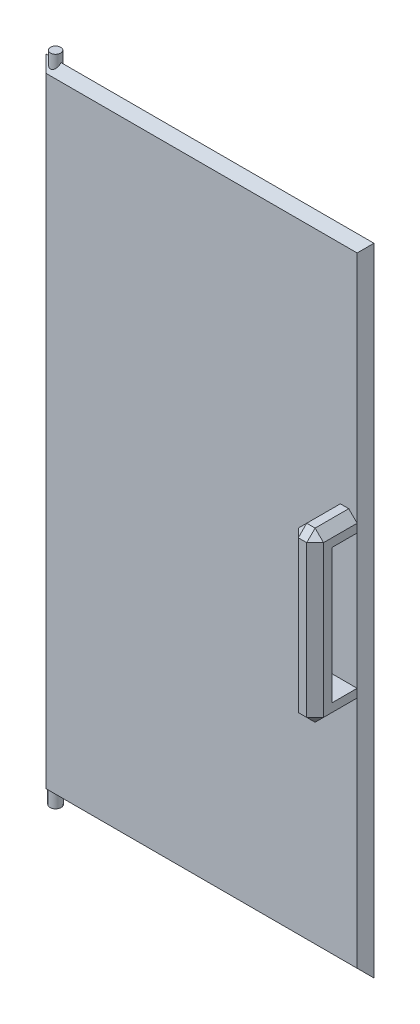
ISO-10303-21;
HEADER;
FILE_DESCRIPTION(('STEP AP214'),'2;1');
FILE_NAME('part.step','',(''),(''),'','','');
FILE_SCHEMA(('AUTOMOTIVE_DESIGN { 1 0 10303 214 1 1 1 1 }'));
ENDSEC;
DATA;
#1=APPLICATION_CONTEXT('core data for automotive mechanical design processes');
#2=APPLICATION_PROTOCOL_DEFINITION('international standard','automotive_design',2000,#1);
#3=PRODUCT_CONTEXT('',#1,'mechanical');
#4=PRODUCT('Part','Part','',(#3));
#5=PRODUCT_RELATED_PRODUCT_CATEGORY('part','',(#4));
#6=PRODUCT_DEFINITION_FORMATION('','',#4);
#7=PRODUCT_DEFINITION_CONTEXT('part definition',#1,'design');
#8=PRODUCT_DEFINITION('design','',#6,#7);
#9=PRODUCT_DEFINITION_SHAPE('','',#8);
#10=(LENGTH_UNIT() NAMED_UNIT(*) SI_UNIT(.MILLI.,.METRE.));
#11=(NAMED_UNIT(*) PLANE_ANGLE_UNIT() SI_UNIT($,.RADIAN.));
#12=(NAMED_UNIT(*) SI_UNIT($,.STERADIAN.) SOLID_ANGLE_UNIT());
#13=UNCERTAINTY_MEASURE_WITH_UNIT(LENGTH_MEASURE(1.E-05),#10,'distance_accuracy_value','');
#14=(GEOMETRIC_REPRESENTATION_CONTEXT(3) GLOBAL_UNCERTAINTY_ASSIGNED_CONTEXT((#13)) GLOBAL_UNIT_ASSIGNED_CONTEXT((#10,
#11,#12)) REPRESENTATION_CONTEXT('',''));
#15=CARTESIAN_POINT('',(0.,0.,0.));
#16=DIRECTION('',(0.,0.,1.));
#17=DIRECTION('',(1.,0.,0.));
#18=AXIS2_PLACEMENT_3D('',#15,#16,#17);
#19=CARTESIAN_POINT('',(0.,0.,20.));
#20=DIRECTION('',(0.,0.,-1.));
#21=DIRECTION('',(-1.,0.,0.));
#22=AXIS2_PLACEMENT_3D('',#19,#20,#21);
#23=PLANE('',#22);
#24=DIRECTION('',(1.,0.,0.));
#25=VECTOR('',#24,1.);
#26=CARTESIAN_POINT('',(289.409313494531,-266.327898550725,20.));
#27=LINE('',#26,#25);
#28=CARTESIAN_POINT('',(309.409313494531,-266.327898550725,20.));
#29=VERTEX_POINT('',#28);
#30=CARTESIAN_POINT('',(339.409313494531,-266.327898550725,20.));
#31=VERTEX_POINT('',#30);
#32=EDGE_CURVE('E221',#29,#31,#27,.T.);
#33=ORIENTED_EDGE('',*,*,#32,.F.);
#34=DIRECTION('',(0.,1.,0.));
#35=VECTOR('',#34,1.);
#36=CARTESIAN_POINT('',(309.409313494531,0.,20.));
#37=LINE('',#36,#35);
#38=CARTESIAN_POINT('',(309.409313494531,-256.327898550725,20.));
#39=VERTEX_POINT('',#38);
#40=EDGE_CURVE('E256',#29,#39,#37,.T.);
#41=ORIENTED_EDGE('',*,*,#40,.T.);
#42=DIRECTION('',(-0.707106781186551,-0.707106781186544,0.));
#43=VECTOR('',#42,1.);
#44=CARTESIAN_POINT('',(282.868606022626,-282.86860602263,20.));
#45=LINE('',#44,#43);
#46=CARTESIAN_POINT('',(319.409313494532,-246.327898550725,20.));
#47=VERTEX_POINT('',#46);
#48=EDGE_CURVE('E11',#39,#47,#45,.F.);
#49=ORIENTED_EDGE('',*,*,#48,.T.);
#50=DIRECTION('',(1.,0.,0.));
#51=VECTOR('',#50,1.);
#52=CARTESIAN_POINT('',(-2.27899087148787E-13,-246.327898550724,20.));
#53=LINE('',#52,#51);
#54=CARTESIAN_POINT('',(329.409313494531,-246.327898550725,20.));
#55=VERTEX_POINT('',#54);
#56=EDGE_CURVE('E206',#47,#55,#53,.T.);
#57=ORIENTED_EDGE('',*,*,#56,.T.);
#58=DIRECTION('',(0.707106781186551,-0.707106781186544,0.));
#59=VECTOR('',#58,1.);
#60=CARTESIAN_POINT('',(41.5407074719015,41.540707471902,20.));
#61=LINE('',#60,#59);
#62=CARTESIAN_POINT('',(339.409313494531,-256.327898550725,20.));
#63=VERTEX_POINT('',#62);
#64=EDGE_CURVE('E415',#55,#63,#61,.T.);
#65=ORIENTED_EDGE('',*,*,#64,.T.);
#66=DIRECTION('',(0.,1.,0.));
#67=VECTOR('',#66,1.);
#68=CARTESIAN_POINT('',(339.409313494531,0.,20.));
#69=LINE('',#68,#67);
#70=CARTESIAN_POINT('',(339.409313494531,22.0721014492754,20.));
#71=VERTEX_POINT('',#70);
#72=EDGE_CURVE('E65',#63,#71,#69,.T.);
#73=ORIENTED_EDGE('',*,*,#72,.T.);
#74=DIRECTION('',(-1.,0.,0.));
#75=VECTOR('',#74,1.);
#76=CARTESIAN_POINT('',(0.,22.0721014492754,20.));
#77=LINE('',#76,#75);
#78=CARTESIAN_POINT('',(-30.5906865054685,22.0721014492754,20.));
#79=VERTEX_POINT('',#78);
#80=EDGE_CURVE('E276',#71,#79,#77,.T.);
#81=ORIENTED_EDGE('',*,*,#80,.T.);
#82=DIRECTION('',(0.,-1.,0.));
#83=VECTOR('',#82,1.);
#84=CARTESIAN_POINT('',(-30.5906865054685,0.,20.));
#85=LINE('',#84,#83);
#86=CARTESIAN_POINT('',(-30.5906865054685,-714.727898550725,20.));
#87=VERTEX_POINT('',#86);
#88=EDGE_CURVE('E286',#79,#87,#85,.T.);
#89=ORIENTED_EDGE('',*,*,#88,.T.);
#90=DIRECTION('',(1.,0.,0.));
#91=VECTOR('',#90,1.);
#92=CARTESIAN_POINT('',(0.,-714.727898550725,20.));
#93=LINE('',#92,#91);
#94=CARTESIAN_POINT('',(339.409313494531,-714.727898550725,20.));
#95=VERTEX_POINT('',#94);
#96=EDGE_CURVE('E283',#87,#95,#93,.T.);
#97=ORIENTED_EDGE('',*,*,#96,.T.);
#98=CARTESIAN_POINT('',(339.409313494531,-436.327898550725,20.));
#99=VERTEX_POINT('',#98);
#100=EDGE_CURVE('E279',#95,#99,#69,.T.);
#101=ORIENTED_EDGE('',*,*,#100,.T.);
#102=DIRECTION('',(-0.707106781186551,-0.707106781186544,0.));
#103=VECTOR('',#102,1.);
#104=CARTESIAN_POINT('',(387.868606022626,-387.868606022631,20.));
#105=LINE('',#104,#103);
#106=CARTESIAN_POINT('',(329.409313494531,-446.327898550725,20.));
#107=VERTEX_POINT('',#106);
#108=EDGE_CURVE('E419',#99,#107,#105,.T.);
#109=ORIENTED_EDGE('',*,*,#108,.T.);
#110=DIRECTION('',(-1.,0.,0.));
#111=VECTOR('',#110,1.);
#112=CARTESIAN_POINT('',(0.,-446.327898550725,20.));
#113=LINE('',#112,#111);
#114=CARTESIAN_POINT('',(319.409313494532,-446.327898550725,20.));
#115=VERTEX_POINT('',#114);
#116=EDGE_CURVE('E259',#107,#115,#113,.T.);
#117=ORIENTED_EDGE('',*,*,#116,.T.);
#118=DIRECTION('',(0.707106781186551,-0.707106781186544,0.));
#119=VECTOR('',#118,1.);
#120=CARTESIAN_POINT('',(-63.4592925280983,-63.459292528099,20.));
#121=LINE('',#120,#119);
#122=CARTESIAN_POINT('',(309.409313494531,-436.327898550725,20.));
#123=VERTEX_POINT('',#122);
#124=EDGE_CURVE('E57',#115,#123,#121,.F.);
#125=ORIENTED_EDGE('',*,*,#124,.T.);
#126=CARTESIAN_POINT('',(309.409313494531,-426.327898550725,20.));
#127=VERTEX_POINT('',#126);
#128=EDGE_CURVE('E217',#123,#127,#37,.T.);
#129=ORIENTED_EDGE('',*,*,#128,.T.);
#130=DIRECTION('',(1.,0.,0.));
#131=VECTOR('',#130,1.);
#132=CARTESIAN_POINT('',(289.409313494531,-426.327898550725,20.));
#133=LINE('',#132,#131);
#134=CARTESIAN_POINT('',(339.409313494531,-426.327898550725,20.));
#135=VERTEX_POINT('',#134);
#136=EDGE_CURVE('E212',#127,#135,#133,.T.);
#137=ORIENTED_EDGE('',*,*,#136,.T.);
#138=DIRECTION('',(0.,1.,0.));
#139=VECTOR('',#138,1.);
#140=CARTESIAN_POINT('',(339.409313494531,0.,20.));
#141=LINE('',#140,#139);
#142=EDGE_CURVE('E214',#135,#31,#141,.T.);
#143=ORIENTED_EDGE('',*,*,#142,.T.);
#144=EDGE_LOOP('',(#33,#41,#49,#57,#65,#73,#81,#89,#97,#101,#109,#117,#125,#129,#137,#143));
#145=FACE_BOUND('',#144,.T.);
#146=ADVANCED_FACE('F45',(#145),#23,.F.);
#147=CARTESIAN_POINT('',(0.,0.,0.));
#148=DIRECTION('',(0.,0.,-1.));
#149=DIRECTION('',(-1.,0.,0.));
#150=AXIS2_PLACEMENT_3D('',#147,#148,#149);
#151=PLANE('',#150);
#152=DIRECTION('',(-1.,0.,0.));
#153=VECTOR('',#152,1.);
#154=CARTESIAN_POINT('',(-40.5906865054685,-714.727898550725,0.));
#155=LINE('',#154,#153);
#156=CARTESIAN_POINT('',(339.409313494531,-714.727898550725,0.));
#157=VERTEX_POINT('',#156);
#158=CARTESIAN_POINT('',(-30.5906865054685,-714.727898550725,0.));
#159=VERTEX_POINT('',#158);
#160=EDGE_CURVE('E296',#157,#159,#155,.T.);
#161=ORIENTED_EDGE('',*,*,#160,.T.);
#162=DIRECTION('',(0.,1.,0.));
#163=VECTOR('',#162,1.);
#164=CARTESIAN_POINT('',(-30.5906865054685,32.0721014492754,0.));
#165=LINE('',#164,#163);
#166=CARTESIAN_POINT('',(-30.5906865054685,22.0721014492754,0.));
#167=VERTEX_POINT('',#166);
#168=EDGE_CURVE('E299',#159,#167,#165,.T.);
#169=ORIENTED_EDGE('',*,*,#168,.T.);
#170=DIRECTION('',(1.,0.,0.));
#171=VECTOR('',#170,1.);
#172=CARTESIAN_POINT('',(349.409313494531,22.0721014492754,0.));
#173=LINE('',#172,#171);
#174=CARTESIAN_POINT('',(339.409313494531,22.0721014492754,0.));
#175=VERTEX_POINT('',#174);
#176=EDGE_CURVE('E290',#167,#175,#173,.T.);
#177=ORIENTED_EDGE('',*,*,#176,.T.);
#178=DIRECTION('',(0.,-1.,0.));
#179=VECTOR('',#178,1.);
#180=CARTESIAN_POINT('',(339.409313494531,-724.727898550725,0.));
#181=LINE('',#180,#179);
#182=EDGE_CURVE('E293',#175,#157,#181,.T.);
#183=ORIENTED_EDGE('',*,*,#182,.T.);
#184=EDGE_LOOP('',(#161,#169,#177,#183));
#185=FACE_BOUND('',#184,.T.);
#186=ADVANCED_FACE('F527',(#185),#151,.T.);
#187=CARTESIAN_POINT('',(-28.7837862799548,42.0721014492754,10.4351380042123));
#188=DIRECTION('',(0.,-1.,0.));
#189=DIRECTION('',(0.,0.,-1.));
#190=AXIS2_PLACEMENT_3D('',#187,#188,#189);
#191=CYLINDRICAL_SURFACE('',#190,6.05);
#192=CARTESIAN_POINT('',(-28.7837862799548,31.636963445063,10.4351380042123));
#193=DIRECTION('',(0.,-0.707106781186551,-0.707106781186543));
#194=DIRECTION('',(0.,-0.707106781186544,0.707106781186551));
#195=AXIS2_PLACEMENT_3D('',#192,#193,#194);
#196=ELLIPSE('',#195,8.55599205235718,6.05);
#197=CARTESIAN_POINT('',(-34.8181176362271,32.0721014492754,9.99999999999988));
#198=VERTEX_POINT('',#197);
#199=CARTESIAN_POINT('',(-22.7494549236826,32.0721014492754,9.99999999999988));
#200=VERTEX_POINT('',#199);
#201=EDGE_CURVE('E307',#198,#200,#196,.F.);
#202=ORIENTED_EDGE('',*,*,#201,.T.);
#203=CARTESIAN_POINT('',(-28.7837862799548,32.5072394534878,10.4351380042123));
#204=DIRECTION('',(0.,0.707106781186544,-0.707106781186551));
#205=DIRECTION('',(0.,-0.707106781186551,-0.707106781186544));
#206=AXIS2_PLACEMENT_3D('',#203,#204,#205);
#207=ELLIPSE('',#206,8.55599205235727,6.05);
#208=EDGE_CURVE('E314',#200,#198,#207,.T.);
#209=ORIENTED_EDGE('',*,*,#208,.T.);
#210=EDGE_LOOP('',(#202,#209));
#211=FACE_BOUND('',#210,.T.);
#212=CARTESIAN_POINT('',(-28.7837862799548,42.0721014492754,10.4351380042123));
#213=DIRECTION('',(0.,1.,0.));
#214=DIRECTION('',(0.,0.,1.));
#215=AXIS2_PLACEMENT_3D('',#212,#213,#214);
#216=CIRCLE('',#215,6.05);
#217=CARTESIAN_POINT('',(-28.7837862799548,42.0721014492754,16.4851380042123));
#218=VERTEX_POINT('',#217);
#219=EDGE_CURVE('E271',#218,#218,#216,.T.);
#220=ORIENTED_EDGE('',*,*,#219,.F.);
#221=EDGE_LOOP('',(#220));
#222=FACE_BOUND('',#221,.T.);
#223=ADVANCED_FACE('F521',(#211,#222),#191,.T.);
#224=CARTESIAN_POINT('',(-28.7837862799548,42.0721014492754,10.4351380042123));
#225=DIRECTION('',(0.,1.,0.));
#226=DIRECTION('',(0.,0.,1.));
#227=AXIS2_PLACEMENT_3D('',#224,#225,#226);
#228=PLANE('',#227);
#229=ORIENTED_EDGE('',*,*,#219,.T.);
#230=EDGE_LOOP('',(#229));
#231=FACE_BOUND('',#230,.T.);
#232=ADVANCED_FACE('F534',(#231),#228,.T.);
#233=CARTESIAN_POINT('',(-28.7837862799548,-734.727898550725,10.4351380042176));
#234=DIRECTION('',(0.,1.,0.));
#235=DIRECTION('',(0.,0.,1.));
#236=AXIS2_PLACEMENT_3D('',#233,#234,#235);
#237=CYLINDRICAL_SURFACE('',#236,6.63104881054694);
#238=CARTESIAN_POINT('',(-28.7837862799548,-724.292760546507,10.4351380042176));
#239=DIRECTION('',(0.,0.707106781186551,-0.707106781186543));
#240=DIRECTION('',(0.,0.707106781186544,0.707106781186551));
#241=AXIS2_PLACEMENT_3D('',#238,#239,#240);
#242=ELLIPSE('',#241,9.37771916063341,6.63104881054694);
#243=CARTESIAN_POINT('',(-22.1670300319779,-724.727898550725,9.99999999999988));
#244=VERTEX_POINT('',#243);
#245=CARTESIAN_POINT('',(-35.4005425279317,-724.727898550725,9.99999999999988));
#246=VERTEX_POINT('',#245);
#247=EDGE_CURVE('E303',#244,#246,#242,.F.);
#248=ORIENTED_EDGE('',*,*,#247,.T.);
#249=CARTESIAN_POINT('',(-28.7837862799548,-725.163036554942,10.4351380042176));
#250=DIRECTION('',(0.,-0.707106781186544,-0.707106781186551));
#251=DIRECTION('',(0.,0.707106781186551,-0.707106781186544));
#252=AXIS2_PLACEMENT_3D('',#249,#250,#251);
#253=ELLIPSE('',#252,9.37771916063351,6.63104881054694);
#254=EDGE_CURVE('E311',#246,#244,#253,.T.);
#255=ORIENTED_EDGE('',*,*,#254,.T.);
#256=EDGE_LOOP('',(#248,#255));
#257=FACE_BOUND('',#256,.T.);
#258=CARTESIAN_POINT('',(-28.7837862799548,-734.727898550725,10.4351380042176));
#259=DIRECTION('',(0.,-1.,0.));
#260=DIRECTION('',(0.,0.,-1.));
#261=AXIS2_PLACEMENT_3D('',#258,#259,#260);
#262=CIRCLE('',#261,6.63104881054694);
#263=CARTESIAN_POINT('',(-28.7837862799548,-734.727898550725,3.80408919367068));
#264=VERTEX_POINT('',#263);
#265=EDGE_CURVE('E267',#264,#264,#262,.T.);
#266=ORIENTED_EDGE('',*,*,#265,.F.);
#267=EDGE_LOOP('',(#266));
#268=FACE_BOUND('',#267,.T.);
#269=ADVANCED_FACE('F704',(#257,#268),#237,.T.);
#270=CARTESIAN_POINT('',(-28.7837862799548,-734.727898550725,10.4351380042176));
#271=DIRECTION('',(0.,-1.,0.));
#272=DIRECTION('',(0.,0.,-1.));
#273=AXIS2_PLACEMENT_3D('',#270,#271,#272);
#274=PLANE('',#273);
#275=ORIENTED_EDGE('',*,*,#265,.T.);
#276=EDGE_LOOP('',(#275));
#277=FACE_BOUND('',#276,.T.);
#278=ADVANCED_FACE('F578',(#277),#274,.T.);
#279=CARTESIAN_POINT('',(349.409313494531,32.0721014492754,9.9999999999999));
#280=DIRECTION('',(0.707106781186544,0.,-0.707106781186551));
#281=DIRECTION('',(0.,-1.,0.));
#282=AXIS2_PLACEMENT_3D('',#279,#280,#281);
#283=PLANE('',#282);
#284=DIRECTION('',(-0.577350269189628,0.577350269189628,-0.577350269189621));
#285=VECTOR('',#284,1.);
#286=CARTESIAN_POINT('',(97.1426468278629,-472.461231884056,-242.266666666666));
#287=LINE('',#286,#285);
#288=CARTESIAN_POINT('',(349.409313494531,-724.727898550725,9.99999999999988));
#289=VERTEX_POINT('',#288);
#290=EDGE_CURVE('E356',#157,#289,#287,.F.);
#291=ORIENTED_EDGE('',*,*,#290,.F.);
#292=ORIENTED_EDGE('',*,*,#182,.F.);
#293=DIRECTION('',(-0.577350269189628,-0.577350269189628,-0.577350269189621));
#294=VECTOR('',#293,1.);
#295=CARTESIAN_POINT('',(219.40931349453,-97.9278985507256,-120.));
#296=LINE('',#295,#294);
#297=CARTESIAN_POINT('',(349.409313494531,32.0721014492754,9.99999999999988));
#298=VERTEX_POINT('',#297);
#299=EDGE_CURVE('E272',#298,#175,#296,.T.);
#300=ORIENTED_EDGE('',*,*,#299,.F.);
#301=DIRECTION('',(0.,1.,0.));
#302=VECTOR('',#301,1.);
#303=CARTESIAN_POINT('',(349.409313494531,32.0721014492754,9.9999999999999));
#304=LINE('',#303,#302);
#305=EDGE_CURVE('E360',#289,#298,#304,.T.);
#306=ORIENTED_EDGE('',*,*,#305,.F.);
#307=EDGE_LOOP('',(#291,#292,#300,#306));
#308=FACE_BOUND('',#307,.T.);
#309=ADVANCED_FACE('F515',(#308),#283,.T.);
#310=CARTESIAN_POINT('',(-40.5906865054685,32.0721014492754,9.9999999999999));
#311=DIRECTION('',(0.,0.707106781186544,-0.707106781186551));
#312=DIRECTION('',(1.,0.,0.));
#313=AXIS2_PLACEMENT_3D('',#310,#311,#312);
#314=PLANE('',#313);
#315=ORIENTED_EDGE('',*,*,#299,.T.);
#316=ORIENTED_EDGE('',*,*,#176,.F.);
#317=DIRECTION('',(-0.577350269189628,0.577350269189628,0.577350269189621));
#318=VECTOR('',#317,1.);
#319=CARTESIAN_POINT('',(-40.5906865054685,32.0721014492754,9.9999999999999));
#320=LINE('',#319,#318);
#321=CARTESIAN_POINT('',(-40.5906865054685,32.0721014492754,9.99999999999988));
#322=VERTEX_POINT('',#321);
#323=EDGE_CURVE('E350',#322,#167,#320,.F.);
#324=ORIENTED_EDGE('',*,*,#323,.F.);
#325=DIRECTION('',(-1.,0.,0.));
#326=VECTOR('',#325,1.);
#327=CARTESIAN_POINT('',(-40.5906865054685,32.0721014492754,9.9999999999999));
#328=LINE('',#327,#326);
#329=EDGE_CURVE('E346',#198,#322,#328,.T.);
#330=ORIENTED_EDGE('',*,*,#329,.F.);
#331=ORIENTED_EDGE('',*,*,#208,.F.);
#332=DIRECTION('',(-1.,0.,0.));
#333=VECTOR('',#332,1.);
#334=CARTESIAN_POINT('',(-40.5906865054685,32.0721014492754,9.9999999999999));
#335=LINE('',#334,#333);
#336=EDGE_CURVE('E343',#298,#200,#335,.T.);
#337=ORIENTED_EDGE('',*,*,#336,.F.);
#338=EDGE_LOOP('',(#315,#316,#324,#330,#331,#337));
#339=FACE_BOUND('',#338,.T.);
#340=ADVANCED_FACE('F518',(#339),#314,.T.);
#341=CARTESIAN_POINT('',(339.409313494531,0.,20.));
#342=DIRECTION('',(-0.707106781186551,0.,-0.707106781186543));
#343=DIRECTION('',(0.,1.,0.));
#344=AXIS2_PLACEMENT_3D('',#341,#342,#343);
#345=PLANE('',#344);
#346=DIRECTION('',(0.577350269189624,-0.577350269189624,-0.57735026918963));
#347=VECTOR('',#346,1.);
#348=CARTESIAN_POINT('',(101.166680644292,-476.485265700485,258.242632850242));
#349=LINE('',#348,#347);
#350=EDGE_CURVE('E335',#289,#95,#349,.F.);
#351=ORIENTED_EDGE('',*,*,#350,.F.);
#352=ORIENTED_EDGE('',*,*,#305,.T.);
#353=DIRECTION('',(0.577350269189624,0.577350269189624,-0.57735026918963));
#354=VECTOR('',#353,1.);
#355=CARTESIAN_POINT('',(226.272875663022,-91.0643363822343,133.136437831511));
#356=LINE('',#355,#354);
#357=EDGE_CURVE('E339',#71,#298,#356,.T.);
#358=ORIENTED_EDGE('',*,*,#357,.F.);
#359=ORIENTED_EDGE('',*,*,#72,.F.);
#360=DIRECTION('',(0.,1.,0.));
#361=VECTOR('',#360,1.);
#362=CARTESIAN_POINT('',(339.409313494531,0.,20.));
#363=LINE('',#362,#361);
#364=EDGE_CURVE('E207',#31,#63,#363,.T.);
#365=ORIENTED_EDGE('',*,*,#364,.F.);
#366=ORIENTED_EDGE('',*,*,#142,.F.);
#367=EDGE_CURVE('E194',#99,#135,#363,.T.);
#368=ORIENTED_EDGE('',*,*,#367,.F.);
#369=ORIENTED_EDGE('',*,*,#100,.F.);
#370=EDGE_LOOP('',(#351,#352,#358,#359,#365,#366,#368,#369));
#371=FACE_BOUND('',#370,.T.);
#372=ADVANCED_FACE('F231',(#371),#345,.F.);
#373=CARTESIAN_POINT('',(349.409313494531,-724.727898550725,9.9999999999999));
#374=DIRECTION('',(0.,-0.707106781186544,-0.707106781186551));
#375=DIRECTION('',(-1.,0.,0.));
#376=AXIS2_PLACEMENT_3D('',#373,#374,#375);
#377=PLANE('',#376);
#378=DIRECTION('',(0.577350269189628,0.577350269189628,-0.577350269189621));
#379=VECTOR('',#378,1.);
#380=CARTESIAN_POINT('',(89.4093134945325,-594.727898550724,-120.));
#381=LINE('',#380,#379);
#382=CARTESIAN_POINT('',(-40.5906865054685,-724.727898550725,9.99999999999988));
#383=VERTEX_POINT('',#382);
#384=EDGE_CURVE('E353',#159,#383,#381,.F.);
#385=ORIENTED_EDGE('',*,*,#384,.F.);
#386=ORIENTED_EDGE('',*,*,#160,.F.);
#387=ORIENTED_EDGE('',*,*,#290,.T.);
#388=DIRECTION('',(1.,0.,0.));
#389=VECTOR('',#388,1.);
#390=CARTESIAN_POINT('',(349.409313494531,-724.727898550725,9.9999999999999));
#391=LINE('',#390,#389);
#392=EDGE_CURVE('E331',#244,#289,#391,.T.);
#393=ORIENTED_EDGE('',*,*,#392,.F.);
#394=ORIENTED_EDGE('',*,*,#254,.F.);
#395=DIRECTION('',(1.,0.,0.));
#396=VECTOR('',#395,1.);
#397=CARTESIAN_POINT('',(349.409313494531,-724.727898550725,9.9999999999999));
#398=LINE('',#397,#396);
#399=EDGE_CURVE('E328',#383,#246,#398,.T.);
#400=ORIENTED_EDGE('',*,*,#399,.F.);
#401=EDGE_LOOP('',(#385,#386,#387,#393,#394,#400));
#402=FACE_BOUND('',#401,.T.);
#403=ADVANCED_FACE('F509',(#402),#377,.T.);
#404=CARTESIAN_POINT('',(-40.5906865054685,-724.727898550725,9.9999999999999));
#405=DIRECTION('',(-0.707106781186544,0.,-0.707106781186551));
#406=DIRECTION('',(0.,1.,0.));
#407=AXIS2_PLACEMENT_3D('',#404,#405,#406);
#408=PLANE('',#407);
#409=ORIENTED_EDGE('',*,*,#168,.F.);
#410=ORIENTED_EDGE('',*,*,#384,.T.);
#411=DIRECTION('',(0.,-1.,0.));
#412=VECTOR('',#411,1.);
#413=CARTESIAN_POINT('',(-40.5906865054685,-724.727898550725,9.9999999999999));
#414=LINE('',#413,#412);
#415=EDGE_CURVE('E324',#322,#383,#414,.T.);
#416=ORIENTED_EDGE('',*,*,#415,.F.);
#417=ORIENTED_EDGE('',*,*,#323,.T.);
#418=EDGE_LOOP('',(#409,#410,#416,#417));
#419=FACE_BOUND('',#418,.T.);
#420=ADVANCED_FACE('F525',(#419),#408,.T.);
#421=CARTESIAN_POINT('',(0.,22.0721014492754,20.));
#422=DIRECTION('',(0.,-0.707106781186551,-0.707106781186543));
#423=DIRECTION('',(-1.,0.,0.));
#424=AXIS2_PLACEMENT_3D('',#421,#422,#423);
#425=PLANE('',#424);
#426=ORIENTED_EDGE('',*,*,#201,.F.);
#427=ORIENTED_EDGE('',*,*,#329,.T.);
#428=DIRECTION('',(0.577350269189624,-0.577350269189624,0.57735026918963));
#429=VECTOR('',#428,1.);
#430=CARTESIAN_POINT('',(-20.3937910036458,11.8752059474526,30.1968955018229));
#431=LINE('',#430,#429);
#432=EDGE_CURVE('E320',#79,#322,#431,.F.);
#433=ORIENTED_EDGE('',*,*,#432,.F.);
#434=ORIENTED_EDGE('',*,*,#80,.F.);
#435=ORIENTED_EDGE('',*,*,#357,.T.);
#436=ORIENTED_EDGE('',*,*,#336,.T.);
#437=EDGE_LOOP('',(#426,#427,#433,#434,#435,#436));
#438=FACE_BOUND('',#437,.T.);
#439=ADVANCED_FACE('F494',(#438),#425,.F.);
#440=CARTESIAN_POINT('',(0.,-714.727898550725,20.));
#441=DIRECTION('',(0.,0.707106781186551,-0.707106781186543));
#442=DIRECTION('',(1.,0.,0.));
#443=AXIS2_PLACEMENT_3D('',#440,#441,#442);
#444=PLANE('',#443);
#445=ORIENTED_EDGE('',*,*,#350,.T.);
#446=ORIENTED_EDGE('',*,*,#96,.F.);
#447=DIRECTION('',(-0.577350269189624,-0.577350269189624,-0.57735026918963));
#448=VECTOR('',#447,1.);
#449=CARTESIAN_POINT('',(-20.3937910036458,-704.531003048902,30.1968955018229));
#450=LINE('',#449,#448);
#451=EDGE_CURVE('E266',#383,#87,#450,.F.);
#452=ORIENTED_EDGE('',*,*,#451,.F.);
#453=ORIENTED_EDGE('',*,*,#399,.T.);
#454=ORIENTED_EDGE('',*,*,#247,.F.);
#455=ORIENTED_EDGE('',*,*,#392,.T.);
#456=EDGE_LOOP('',(#445,#446,#452,#453,#454,#455));
#457=FACE_BOUND('',#456,.T.);
#458=ADVANCED_FACE('F503',(#457),#444,.F.);
#459=CARTESIAN_POINT('',(-30.5906865054685,0.,20.));
#460=DIRECTION('',(0.707106781186551,0.,-0.707106781186543));
#461=DIRECTION('',(0.,-1.,0.));
#462=AXIS2_PLACEMENT_3D('',#459,#460,#461);
#463=PLANE('',#462);
#464=ORIENTED_EDGE('',*,*,#432,.T.);
#465=ORIENTED_EDGE('',*,*,#415,.T.);
#466=ORIENTED_EDGE('',*,*,#451,.T.);
#467=ORIENTED_EDGE('',*,*,#88,.F.);
#468=EDGE_LOOP('',(#464,#465,#466,#467));
#469=FACE_BOUND('',#468,.T.);
#470=ADVANCED_FACE('F499',(#469),#463,.F.);
#471=CARTESIAN_POINT('',(309.409313494531,0.,70.));
#472=DIRECTION('',(-1.,0.,0.));
#473=DIRECTION('',(0.,0.,1.));
#474=AXIS2_PLACEMENT_3D('',#471,#472,#473);
#475=PLANE('',#474);
#476=ORIENTED_EDGE('',*,*,#128,.F.);
#477=DIRECTION('',(0.,0.,1.));
#478=VECTOR('',#477,1.);
#479=CARTESIAN_POINT('',(309.409313494531,-436.327898550725,70.));
#480=LINE('',#479,#478);
#481=CARTESIAN_POINT('',(309.409313494531,-436.327898550725,60.));
#482=VERTEX_POINT('',#481);
#483=EDGE_CURVE('E412',#123,#482,#480,.T.);
#484=ORIENTED_EDGE('',*,*,#483,.T.);
#485=DIRECTION('',(0.,1.,0.));
#486=VECTOR('',#485,1.);
#487=CARTESIAN_POINT('',(309.409313494531,0.,60.));
#488=LINE('',#487,#486);
#489=CARTESIAN_POINT('',(309.409313494531,-256.327898550725,60.));
#490=VERTEX_POINT('',#489);
#491=EDGE_CURVE('E409',#482,#490,#488,.T.);
#492=ORIENTED_EDGE('',*,*,#491,.T.);
#493=DIRECTION('',(0.,0.,-1.));
#494=VECTOR('',#493,1.);
#495=CARTESIAN_POINT('',(309.409313494531,-256.327898550725,70.));
#496=LINE('',#495,#494);
#497=EDGE_CURVE('E406',#490,#39,#496,.T.);
#498=ORIENTED_EDGE('',*,*,#497,.T.);
#499=ORIENTED_EDGE('',*,*,#40,.F.);
#500=DIRECTION('',(0.,0.,-1.));
#501=VECTOR('',#500,1.);
#502=CARTESIAN_POINT('',(309.409313494531,-266.327898550725,70.));
#503=LINE('',#502,#501);
#504=CARTESIAN_POINT('',(309.409313494531,-266.327898550725,50.));
#505=VERTEX_POINT('',#504);
#506=EDGE_CURVE('E250',#505,#29,#503,.T.);
#507=ORIENTED_EDGE('',*,*,#506,.F.);
#508=DIRECTION('',(0.,1.,0.));
#509=VECTOR('',#508,1.);
#510=CARTESIAN_POINT('',(309.409313494531,0.,50.));
#511=LINE('',#510,#509);
#512=CARTESIAN_POINT('',(309.409313494531,-426.327898550725,50.));
#513=VERTEX_POINT('',#512);
#514=EDGE_CURVE('E253',#513,#505,#511,.T.);
#515=ORIENTED_EDGE('',*,*,#514,.F.);
#516=DIRECTION('',(0.,0.,1.));
#517=VECTOR('',#516,1.);
#518=CARTESIAN_POINT('',(309.409313494531,-426.327898550725,70.));
#519=LINE('',#518,#517);
#520=EDGE_CURVE('E243',#127,#513,#519,.T.);
#521=ORIENTED_EDGE('',*,*,#520,.F.);
#522=EDGE_LOOP('',(#476,#484,#492,#498,#499,#507,#515,#521));
#523=FACE_BOUND('',#522,.T.);
#524=ADVANCED_FACE('F482',(#523),#475,.T.);
#525=CARTESIAN_POINT('',(0.,-446.327898550725,70.));
#526=DIRECTION('',(0.,-1.,0.));
#527=DIRECTION('',(0.,0.,-1.));
#528=AXIS2_PLACEMENT_3D('',#525,#526,#527);
#529=PLANE('',#528);
#530=ORIENTED_EDGE('',*,*,#116,.F.);
#531=DIRECTION('',(0.,0.,1.));
#532=VECTOR('',#531,1.);
#533=CARTESIAN_POINT('',(329.409313494531,-446.327898550725,70.));
#534=LINE('',#533,#532);
#535=CARTESIAN_POINT('',(329.409313494531,-446.327898550725,60.));
#536=VERTEX_POINT('',#535);
#537=EDGE_CURVE('E403',#107,#536,#534,.T.);
#538=ORIENTED_EDGE('',*,*,#537,.T.);
#539=DIRECTION('',(-1.,0.,0.));
#540=VECTOR('',#539,1.);
#541=CARTESIAN_POINT('',(0.,-446.327898550725,60.));
#542=LINE('',#541,#540);
#543=CARTESIAN_POINT('',(319.409313494532,-446.327898550725,60.));
#544=VERTEX_POINT('',#543);
#545=EDGE_CURVE('E400',#536,#544,#542,.T.);
#546=ORIENTED_EDGE('',*,*,#545,.T.);
#547=DIRECTION('',(0.,0.,-1.));
#548=VECTOR('',#547,1.);
#549=CARTESIAN_POINT('',(319.409313494532,-446.327898550725,70.));
#550=LINE('',#549,#548);
#551=EDGE_CURVE('E397',#544,#115,#550,.T.);
#552=ORIENTED_EDGE('',*,*,#551,.T.);
#553=EDGE_LOOP('',(#530,#538,#546,#552));
#554=FACE_BOUND('',#553,.T.);
#555=ADVANCED_FACE('F662',(#554),#529,.T.);
#556=CARTESIAN_POINT('',(339.409313494531,0.,70.));
#557=DIRECTION('',(-1.,0.,0.));
#558=DIRECTION('',(0.,0.,1.));
#559=AXIS2_PLACEMENT_3D('',#556,#557,#558);
#560=PLANE('',#559);
#561=ORIENTED_EDGE('',*,*,#364,.T.);
#562=DIRECTION('',(0.,0.,1.));
#563=VECTOR('',#562,1.);
#564=CARTESIAN_POINT('',(339.409313494531,-256.327898550725,70.));
#565=LINE('',#564,#563);
#566=CARTESIAN_POINT('',(339.409313494531,-256.327898550725,59.9999999999999));
#567=VERTEX_POINT('',#566);
#568=EDGE_CURVE('E394',#63,#567,#565,.T.);
#569=ORIENTED_EDGE('',*,*,#568,.T.);
#570=DIRECTION('',(0.,-1.,0.));
#571=VECTOR('',#570,1.);
#572=CARTESIAN_POINT('',(339.409313494531,-446.327898550725,59.9999999999999));
#573=LINE('',#572,#571);
#574=CARTESIAN_POINT('',(339.409313494531,-436.327898550725,59.9999999999999));
#575=VERTEX_POINT('',#574);
#576=EDGE_CURVE('E391',#567,#575,#573,.T.);
#577=ORIENTED_EDGE('',*,*,#576,.T.);
#578=DIRECTION('',(0.,0.,-1.));
#579=VECTOR('',#578,1.);
#580=CARTESIAN_POINT('',(339.409313494531,-436.327898550725,20.));
#581=LINE('',#580,#579);
#582=EDGE_CURVE('E201',#575,#99,#581,.T.);
#583=ORIENTED_EDGE('',*,*,#582,.T.);
#584=ORIENTED_EDGE('',*,*,#367,.T.);
#585=DIRECTION('',(0.,0.,-1.));
#586=VECTOR('',#585,1.);
#587=CARTESIAN_POINT('',(339.409313494531,-426.327898550725,0.));
#588=LINE('',#587,#586);
#589=CARTESIAN_POINT('',(339.409313494531,-426.327898550725,50.));
#590=VERTEX_POINT('',#589);
#591=EDGE_CURVE('E199',#590,#135,#588,.T.);
#592=ORIENTED_EDGE('',*,*,#591,.F.);
#593=DIRECTION('',(0.,-1.,0.));
#594=VECTOR('',#593,1.);
#595=CARTESIAN_POINT('',(339.409313494531,0.,50.));
#596=LINE('',#595,#594);
#597=CARTESIAN_POINT('',(339.409313494531,-266.327898550725,50.));
#598=VERTEX_POINT('',#597);
#599=EDGE_CURVE('E228',#598,#590,#596,.T.);
#600=ORIENTED_EDGE('',*,*,#599,.F.);
#601=DIRECTION('',(0.,0.,1.));
#602=VECTOR('',#601,1.);
#603=CARTESIAN_POINT('',(339.409313494531,-266.327898550725,0.));
#604=LINE('',#603,#602);
#605=EDGE_CURVE('E233',#31,#598,#604,.T.);
#606=ORIENTED_EDGE('',*,*,#605,.F.);
#607=EDGE_LOOP('',(#561,#569,#577,#583,#584,#592,#600,#606));
#608=FACE_BOUND('',#607,.T.);
#609=ADVANCED_FACE('F196',(#608),#560,.F.);
#610=CARTESIAN_POINT('',(-2.27899087148787E-13,-246.327898550724,70.));
#611=DIRECTION('',(0.,1.,0.));
#612=DIRECTION('',(-1.,0.,0.));
#613=AXIS2_PLACEMENT_3D('',#610,#611,#612);
#614=PLANE('',#613);
#615=DIRECTION('',(1.,0.,0.));
#616=VECTOR('',#615,1.);
#617=CARTESIAN_POINT('',(-2.27899087148787E-13,-246.327898550724,59.9999999999999));
#618=LINE('',#617,#616);
#619=CARTESIAN_POINT('',(319.409313494532,-246.327898550725,59.9999999999999));
#620=VERTEX_POINT('',#619);
#621=CARTESIAN_POINT('',(329.409313494531,-246.327898550725,59.9999999999999));
#622=VERTEX_POINT('',#621);
#623=EDGE_CURVE('E369',#620,#622,#618,.T.);
#624=ORIENTED_EDGE('',*,*,#623,.T.);
#625=DIRECTION('',(0.,0.,-1.));
#626=VECTOR('',#625,1.);
#627=CARTESIAN_POINT('',(329.409313494531,-246.327898550725,20.));
#628=LINE('',#627,#626);
#629=EDGE_CURVE('E373',#622,#55,#628,.T.);
#630=ORIENTED_EDGE('',*,*,#629,.T.);
#631=ORIENTED_EDGE('',*,*,#56,.F.);
#632=DIRECTION('',(0.,0.,1.));
#633=VECTOR('',#632,1.);
#634=CARTESIAN_POINT('',(319.409313494532,-246.327898550725,70.));
#635=LINE('',#634,#633);
#636=EDGE_CURVE('E317',#47,#620,#635,.T.);
#637=ORIENTED_EDGE('',*,*,#636,.T.);
#638=EDGE_LOOP('',(#624,#630,#631,#637));
#639=FACE_BOUND('',#638,.T.);
#640=ADVANCED_FACE('F682',(#639),#614,.T.);
#641=CARTESIAN_POINT('',(0.,0.,70.));
#642=DIRECTION('',(0.,0.,1.));
#643=DIRECTION('',(1.,0.,0.));
#644=AXIS2_PLACEMENT_3D('',#641,#642,#643);
#645=PLANE('',#644);
#646=DIRECTION('',(0.,1.,0.));
#647=VECTOR('',#646,1.);
#648=CARTESIAN_POINT('',(329.409313494531,-246.327898550725,70.));
#649=LINE('',#648,#647);
#650=CARTESIAN_POINT('',(329.409313494531,-436.327898550725,70.));
#651=VERTEX_POINT('',#650);
#652=CARTESIAN_POINT('',(329.409313494531,-256.327898550725,70.));
#653=VERTEX_POINT('',#652);
#654=EDGE_CURVE('E382',#651,#653,#649,.T.);
#655=ORIENTED_EDGE('',*,*,#654,.T.);
#656=DIRECTION('',(-1.,0.,0.));
#657=VECTOR('',#656,1.);
#658=CARTESIAN_POINT('',(-2.3715094568733E-13,-256.327898550724,70.));
#659=LINE('',#658,#657);
#660=CARTESIAN_POINT('',(319.409313494532,-256.327898550725,70.));
#661=VERTEX_POINT('',#660);
#662=EDGE_CURVE('E385',#653,#661,#659,.T.);
#663=ORIENTED_EDGE('',*,*,#662,.T.);
#664=DIRECTION('',(0.,-1.,0.));
#665=VECTOR('',#664,1.);
#666=CARTESIAN_POINT('',(319.409313494532,0.,70.));
#667=LINE('',#666,#665);
#668=CARTESIAN_POINT('',(319.409313494532,-436.327898550725,70.));
#669=VERTEX_POINT('',#668);
#670=EDGE_CURVE('E376',#661,#669,#667,.T.);
#671=ORIENTED_EDGE('',*,*,#670,.T.);
#672=DIRECTION('',(1.,0.,0.));
#673=VECTOR('',#672,1.);
#674=CARTESIAN_POINT('',(0.,-436.327898550725,70.));
#675=LINE('',#674,#673);
#676=EDGE_CURVE('E379',#669,#651,#675,.T.);
#677=ORIENTED_EDGE('',*,*,#676,.T.);
#678=EDGE_LOOP('',(#655,#663,#671,#677));
#679=FACE_BOUND('',#678,.T.);
#680=ADVANCED_FACE('F670',(#679),#645,.T.);
#681=CARTESIAN_POINT('',(289.409313494531,0.,50.));
#682=DIRECTION('',(0.,0.,1.));
#683=DIRECTION('',(1.,0.,0.));
#684=AXIS2_PLACEMENT_3D('',#681,#682,#683);
#685=PLANE('',#684);
#686=ORIENTED_EDGE('',*,*,#514,.T.);
#687=DIRECTION('',(1.,0.,0.));
#688=VECTOR('',#687,1.);
#689=CARTESIAN_POINT('',(289.409313494531,-266.327898550725,50.));
#690=LINE('',#689,#688);
#691=EDGE_CURVE('E240',#505,#598,#690,.T.);
#692=ORIENTED_EDGE('',*,*,#691,.T.);
#693=ORIENTED_EDGE('',*,*,#599,.T.);
#694=DIRECTION('',(1.,0.,0.));
#695=VECTOR('',#694,1.);
#696=CARTESIAN_POINT('',(289.409313494531,-426.327898550725,50.));
#697=LINE('',#696,#695);
#698=EDGE_CURVE('E222',#513,#590,#697,.T.);
#699=ORIENTED_EDGE('',*,*,#698,.F.);
#700=EDGE_LOOP('',(#686,#692,#693,#699));
#701=FACE_BOUND('',#700,.T.);
#702=ADVANCED_FACE('F472',(#701),#685,.F.);
#703=CARTESIAN_POINT('',(289.409313494531,-266.327898550725,0.));
#704=DIRECTION('',(0.,1.,0.));
#705=DIRECTION('',(0.,0.,1.));
#706=AXIS2_PLACEMENT_3D('',#703,#704,#705);
#707=PLANE('',#706);
#708=ORIENTED_EDGE('',*,*,#506,.T.);
#709=ORIENTED_EDGE('',*,*,#32,.T.);
#710=ORIENTED_EDGE('',*,*,#605,.T.);
#711=ORIENTED_EDGE('',*,*,#691,.F.);
#712=EDGE_LOOP('',(#708,#709,#710,#711));
#713=FACE_BOUND('',#712,.T.);
#714=ADVANCED_FACE('F476',(#713),#707,.F.);
#715=CARTESIAN_POINT('',(289.409313494531,-426.327898550725,0.));
#716=DIRECTION('',(0.,-1.,0.));
#717=DIRECTION('',(0.,0.,-1.));
#718=AXIS2_PLACEMENT_3D('',#715,#716,#717);
#719=PLANE('',#718);
#720=ORIENTED_EDGE('',*,*,#520,.T.);
#721=ORIENTED_EDGE('',*,*,#698,.T.);
#722=ORIENTED_EDGE('',*,*,#591,.T.);
#723=ORIENTED_EDGE('',*,*,#136,.F.);
#724=EDGE_LOOP('',(#720,#721,#722,#723));
#725=FACE_BOUND('',#724,.T.);
#726=ADVANCED_FACE('F225',(#725),#719,.F.);
#727=CARTESIAN_POINT('',(319.409313494532,-446.327898550725,70.));
#728=DIRECTION('',(0.707106781186543,0.707106781186551,0.));
#729=DIRECTION('',(0.,0.,-1.));
#730=AXIS2_PLACEMENT_3D('',#727,#728,#729);
#731=PLANE('',#730);
#732=ORIENTED_EDGE('',*,*,#124,.F.);
#733=ORIENTED_EDGE('',*,*,#551,.F.);
#734=DIRECTION('',(-0.707106781186552,0.707106781186544,0.));
#735=VECTOR('',#734,1.);
#736=CARTESIAN_POINT('',(319.409313494532,-446.327898550725,60.));
#737=LINE('',#736,#735);
#738=EDGE_CURVE('E461',#482,#544,#737,.F.);
#739=ORIENTED_EDGE('',*,*,#738,.F.);
#740=ORIENTED_EDGE('',*,*,#483,.F.);
#741=EDGE_LOOP('',(#732,#733,#739,#740));
#742=FACE_BOUND('',#741,.T.);
#743=ADVANCED_FACE('F48',(#742),#731,.F.);
#744=CARTESIAN_POINT('',(339.409313494531,-436.327898550725,70.));
#745=DIRECTION('',(0.707106781186543,-0.707106781186551,0.));
#746=DIRECTION('',(0.,0.,1.));
#747=AXIS2_PLACEMENT_3D('',#744,#745,#746);
#748=PLANE('',#747);
#749=ORIENTED_EDGE('',*,*,#108,.F.);
#750=ORIENTED_EDGE('',*,*,#582,.F.);
#751=DIRECTION('',(0.707106781186552,0.707106781186544,0.));
#752=VECTOR('',#751,1.);
#753=CARTESIAN_POINT('',(339.409313494531,-436.327898550725,59.9999999999999));
#754=LINE('',#753,#752);
#755=EDGE_CURVE('E458',#536,#575,#754,.T.);
#756=ORIENTED_EDGE('',*,*,#755,.F.);
#757=ORIENTED_EDGE('',*,*,#537,.F.);
#758=EDGE_LOOP('',(#749,#750,#756,#757));
#759=FACE_BOUND('',#758,.T.);
#760=ADVANCED_FACE('F647',(#759),#748,.T.);
#761=CARTESIAN_POINT('',(0.,-446.327898550725,60.));
#762=DIRECTION('',(0.,0.707106781186543,-0.707106781186551));
#763=DIRECTION('',(-1.,0.,0.));
#764=AXIS2_PLACEMENT_3D('',#761,#762,#763);
#765=PLANE('',#764);
#766=DIRECTION('',(0.,-0.707106781186551,-0.707106781186543));
#767=VECTOR('',#766,1.);
#768=CARTESIAN_POINT('',(319.409313494532,-446.327898550725,60.));
#769=LINE('',#768,#767);
#770=EDGE_CURVE('E50',#544,#669,#769,.F.);
#771=ORIENTED_EDGE('',*,*,#770,.F.);
#772=ORIENTED_EDGE('',*,*,#545,.F.);
#773=DIRECTION('',(0.,0.707106781186552,0.707106781186544));
#774=VECTOR('',#773,1.);
#775=CARTESIAN_POINT('',(329.409313494531,-441.327898550725,65.));
#776=LINE('',#775,#774);
#777=EDGE_CURVE('E454',#651,#536,#776,.F.);
#778=ORIENTED_EDGE('',*,*,#777,.F.);
#779=ORIENTED_EDGE('',*,*,#676,.F.);
#780=EDGE_LOOP('',(#771,#772,#778,#779));
#781=FACE_BOUND('',#780,.T.);
#782=ADVANCED_FACE('F642',(#781),#765,.F.);
#783=CARTESIAN_POINT('',(319.409313494532,-446.327898550725,60.));
#784=DIRECTION('',(-0.577350269189619,-0.577350269189626,0.577350269189632));
#785=DIRECTION('',(0.,-0.707106781186551,-0.707106781186544));
#786=AXIS2_PLACEMENT_3D('',#783,#784,#785);
#787=PLANE('',#786);
#788=ORIENTED_EDGE('',*,*,#738,.T.);
#789=ORIENTED_EDGE('',*,*,#770,.T.);
#790=DIRECTION('',(0.707106781186552,0.,0.707106781186544));
#791=VECTOR('',#790,1.);
#792=CARTESIAN_POINT('',(314.409313494532,-436.327898550725,65.));
#793=LINE('',#792,#791);
#794=EDGE_CURVE('E450',#482,#669,#793,.T.);
#795=ORIENTED_EDGE('',*,*,#794,.F.);
#796=EDGE_LOOP('',(#788,#789,#795));
#797=FACE_BOUND('',#796,.T.);
#798=ADVANCED_FACE('F635',(#797),#787,.T.);
#799=CARTESIAN_POINT('',(339.409313494531,-436.327898550725,59.9999999999999));
#800=DIRECTION('',(0.577350269189626,-0.577350269189626,0.577350269189626));
#801=DIRECTION('',(0.707106781186548,0.,-0.707106781186548));
#802=AXIS2_PLACEMENT_3D('',#799,#800,#801);
#803=PLANE('',#802);
#804=ORIENTED_EDGE('',*,*,#777,.T.);
#805=ORIENTED_EDGE('',*,*,#755,.T.);
#806=DIRECTION('',(-0.707106781186544,0.,0.707106781186552));
#807=VECTOR('',#806,1.);
#808=CARTESIAN_POINT('',(339.409313494531,-436.327898550725,59.9999999999999));
#809=LINE('',#808,#807);
#810=EDGE_CURVE('E446',#651,#575,#809,.F.);
#811=ORIENTED_EDGE('',*,*,#810,.F.);
#812=EDGE_LOOP('',(#804,#805,#811));
#813=FACE_BOUND('',#812,.T.);
#814=ADVANCED_FACE('F628',(#813),#803,.T.);
#815=CARTESIAN_POINT('',(309.409313494531,0.,60.));
#816=DIRECTION('',(0.707106781186543,0.,-0.707106781186551));
#817=DIRECTION('',(0.,1.,0.));
#818=AXIS2_PLACEMENT_3D('',#815,#816,#817);
#819=PLANE('',#818);
#820=ORIENTED_EDGE('',*,*,#794,.T.);
#821=ORIENTED_EDGE('',*,*,#670,.F.);
#822=DIRECTION('',(-0.707106781186552,0.,-0.707106781186544));
#823=VECTOR('',#822,1.);
#824=CARTESIAN_POINT('',(319.409313494532,-256.327898550725,70.));
#825=LINE('',#824,#823);
#826=EDGE_CURVE('E442',#490,#661,#825,.F.);
#827=ORIENTED_EDGE('',*,*,#826,.F.);
#828=ORIENTED_EDGE('',*,*,#491,.F.);
#829=EDGE_LOOP('',(#820,#821,#827,#828));
#830=FACE_BOUND('',#829,.T.);
#831=ADVANCED_FACE('F621',(#830),#819,.F.);
#832=CARTESIAN_POINT('',(309.409313494531,-256.327898550725,70.));
#833=DIRECTION('',(0.707106781186543,-0.707106781186551,0.));
#834=DIRECTION('',(0.,0.,-1.));
#835=AXIS2_PLACEMENT_3D('',#832,#833,#834);
#836=PLANE('',#835);
#837=ORIENTED_EDGE('',*,*,#48,.F.);
#838=ORIENTED_EDGE('',*,*,#497,.F.);
#839=DIRECTION('',(0.707106781186552,0.707106781186544,0.));
#840=VECTOR('',#839,1.);
#841=CARTESIAN_POINT('',(314.409313494532,-251.327898550725,59.9999999999999));
#842=LINE('',#841,#840);
#843=EDGE_CURVE('E438',#620,#490,#842,.F.);
#844=ORIENTED_EDGE('',*,*,#843,.F.);
#845=ORIENTED_EDGE('',*,*,#636,.F.);
#846=EDGE_LOOP('',(#837,#838,#844,#845));
#847=FACE_BOUND('',#846,.T.);
#848=ADVANCED_FACE('F614',(#847),#836,.F.);
#849=CARTESIAN_POINT('',(329.409313494531,-246.327898550725,70.));
#850=DIRECTION('',(0.707106781186543,0.707106781186551,0.));
#851=DIRECTION('',(0.,0.,1.));
#852=AXIS2_PLACEMENT_3D('',#849,#850,#851);
#853=PLANE('',#852);
#854=ORIENTED_EDGE('',*,*,#64,.F.);
#855=ORIENTED_EDGE('',*,*,#629,.F.);
#856=DIRECTION('',(-0.707106781186551,0.707106781186543,0.));
#857=VECTOR('',#856,1.);
#858=CARTESIAN_POINT('',(329.409313494531,-246.327898550725,59.9999999999999));
#859=LINE('',#858,#857);
#860=EDGE_CURVE('E434',#567,#622,#859,.T.);
#861=ORIENTED_EDGE('',*,*,#860,.F.);
#862=ORIENTED_EDGE('',*,*,#568,.F.);
#863=EDGE_LOOP('',(#854,#855,#861,#862));
#864=FACE_BOUND('',#863,.T.);
#865=ADVANCED_FACE('F607',(#864),#853,.T.);
#866=CARTESIAN_POINT('',(329.409313494531,0.,70.));
#867=DIRECTION('',(0.707106781186551,0.,0.707106781186543));
#868=DIRECTION('',(0.,-1.,0.));
#869=AXIS2_PLACEMENT_3D('',#866,#867,#868);
#870=PLANE('',#869);
#871=ORIENTED_EDGE('',*,*,#810,.T.);
#872=ORIENTED_EDGE('',*,*,#576,.F.);
#873=DIRECTION('',(0.707106781186544,0.,-0.707106781186552));
#874=VECTOR('',#873,1.);
#875=CARTESIAN_POINT('',(334.409313494531,-256.327898550725,64.9999999999999));
#876=LINE('',#875,#874);
#877=EDGE_CURVE('E430',#653,#567,#876,.T.);
#878=ORIENTED_EDGE('',*,*,#877,.F.);
#879=ORIENTED_EDGE('',*,*,#654,.F.);
#880=EDGE_LOOP('',(#871,#872,#878,#879));
#881=FACE_BOUND('',#880,.T.);
#882=ADVANCED_FACE('F600',(#881),#870,.T.);
#883=CARTESIAN_POINT('',(319.409313494532,-256.327898550725,70.));
#884=DIRECTION('',(-0.577350269189619,0.577350269189632,0.577350269189626));
#885=DIRECTION('',(0.,-0.707106781186544,0.707106781186551));
#886=AXIS2_PLACEMENT_3D('',#883,#884,#885);
#887=PLANE('',#886);
#888=ORIENTED_EDGE('',*,*,#843,.T.);
#889=ORIENTED_EDGE('',*,*,#826,.T.);
#890=DIRECTION('',(0.,-0.707106781186545,0.70710678118655));
#891=VECTOR('',#890,1.);
#892=CARTESIAN_POINT('',(319.409313494532,-256.327898550725,70.));
#893=LINE('',#892,#891);
#894=EDGE_CURVE('E427',#620,#661,#893,.T.);
#895=ORIENTED_EDGE('',*,*,#894,.F.);
#896=EDGE_LOOP('',(#888,#889,#895));
#897=FACE_BOUND('',#896,.T.);
#898=ADVANCED_FACE('F593',(#897),#887,.T.);
#899=CARTESIAN_POINT('',(329.409313494531,-246.327898550725,59.9999999999999));
#900=DIRECTION('',(0.577350269189626,0.577350269189632,0.577350269189619));
#901=DIRECTION('',(-0.707106781186551,0.707106781186544,0.));
#902=AXIS2_PLACEMENT_3D('',#899,#900,#901);
#903=PLANE('',#902);
#904=ORIENTED_EDGE('',*,*,#877,.T.);
#905=ORIENTED_EDGE('',*,*,#860,.T.);
#906=DIRECTION('',(0.,0.707106781186545,-0.70710678118655));
#907=VECTOR('',#906,1.);
#908=CARTESIAN_POINT('',(329.409313494531,-246.327898550725,59.9999999999999));
#909=LINE('',#908,#907);
#910=EDGE_CURVE('E424',#653,#622,#909,.T.);
#911=ORIENTED_EDGE('',*,*,#910,.F.);
#912=EDGE_LOOP('',(#904,#905,#911));
#913=FACE_BOUND('',#912,.T.);
#914=ADVANCED_FACE('F586',(#913),#903,.T.);
#915=CARTESIAN_POINT('',(-2.27899087148787E-13,-246.327898550724,59.9999999999999));
#916=DIRECTION('',(0.,-0.70710678118655,-0.707106781186545));
#917=DIRECTION('',(1.,0.,0.));
#918=AXIS2_PLACEMENT_3D('',#915,#916,#917);
#919=PLANE('',#918);
#920=ORIENTED_EDGE('',*,*,#894,.T.);
#921=ORIENTED_EDGE('',*,*,#662,.F.);
#922=ORIENTED_EDGE('',*,*,#910,.T.);
#923=ORIENTED_EDGE('',*,*,#623,.F.);
#924=EDGE_LOOP('',(#920,#921,#922,#923));
#925=FACE_BOUND('',#924,.T.);
#926=ADVANCED_FACE('F580',(#925),#919,.F.);
#927=CLOSED_SHELL('',(#146,#186,#223,#232,#269,#278,#309,#340,#372,#403,#420,#439,#458,#470,
#524,#555,#609,#640,#680,#702,#714,#726,#743,#760,#782,#798,#814,#831,#848,#865,#882,#898,#914,#926));
#928=MANIFOLD_SOLID_BREP('B2',#927);
#929=ADVANCED_BREP_SHAPE_REPRESENTATION('',(#18,#928),#14);
#930=SHAPE_DEFINITION_REPRESENTATION(#9,#929);
ENDSEC;
END-ISO-10303-21;
